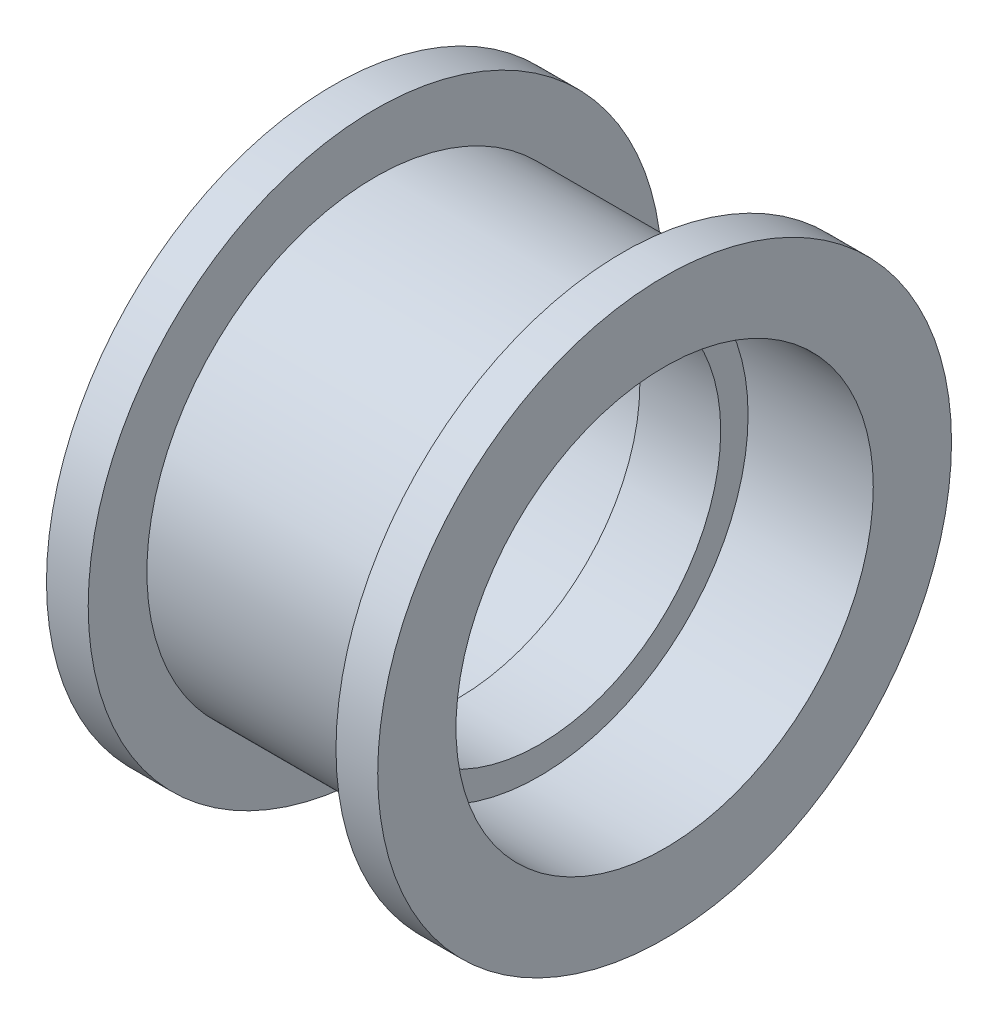
ISO-10303-21;
HEADER;
FILE_DESCRIPTION(('STEP AP214'),'2;1');
FILE_NAME('part.step','',(''),(''),'','','');
FILE_SCHEMA(('AUTOMOTIVE_DESIGN { 1 0 10303 214 1 1 1 1 }'));
ENDSEC;
DATA;
#1=APPLICATION_CONTEXT('core data for automotive mechanical design processes');
#2=APPLICATION_PROTOCOL_DEFINITION('international standard','automotive_design',2000,#1);
#3=PRODUCT_CONTEXT('',#1,'mechanical');
#4=PRODUCT('Part','Part','',(#3));
#5=PRODUCT_RELATED_PRODUCT_CATEGORY('part','',(#4));
#6=PRODUCT_DEFINITION_FORMATION('','',#4);
#7=PRODUCT_DEFINITION_CONTEXT('part definition',#1,'design');
#8=PRODUCT_DEFINITION('design','',#6,#7);
#9=PRODUCT_DEFINITION_SHAPE('','',#8);
#10=(LENGTH_UNIT() NAMED_UNIT(*) SI_UNIT(.MILLI.,.METRE.));
#11=(NAMED_UNIT(*) PLANE_ANGLE_UNIT() SI_UNIT($,.RADIAN.));
#12=(NAMED_UNIT(*) SI_UNIT($,.STERADIAN.) SOLID_ANGLE_UNIT());
#13=UNCERTAINTY_MEASURE_WITH_UNIT(LENGTH_MEASURE(1.E-05),#10,'distance_accuracy_value','');
#14=(GEOMETRIC_REPRESENTATION_CONTEXT(3) GLOBAL_UNCERTAINTY_ASSIGNED_CONTEXT((#13)) GLOBAL_UNIT_ASSIGNED_CONTEXT((#10,
#11,#12)) REPRESENTATION_CONTEXT('',''));
#15=CARTESIAN_POINT('',(0.,0.,0.));
#16=DIRECTION('',(0.,0.,1.));
#17=DIRECTION('',(1.,0.,0.));
#18=AXIS2_PLACEMENT_3D('',#15,#16,#17);
#19=CARTESIAN_POINT('',(-1.55,6.95,0.));
#20=DIRECTION('',(-1.,0.,0.));
#21=DIRECTION('',(0.,0.,1.));
#22=AXIS2_PLACEMENT_3D('',#19,#20,#21);
#23=PLANE('',#22);
#24=CARTESIAN_POINT('',(-1.55,0.,0.));
#25=DIRECTION('',(1.,0.,0.));
#26=DIRECTION('',(0.,0.,-1.));
#27=AXIS2_PLACEMENT_3D('',#24,#25,#26);
#28=CIRCLE('',#27,6.95);
#29=CARTESIAN_POINT('',(-1.55,0.,-6.95));
#30=VERTEX_POINT('',#29);
#31=EDGE_CURVE('E10',#30,#30,#28,.T.);
#32=ORIENTED_EDGE('',*,*,#31,.T.);
#33=EDGE_LOOP('',(#32));
#34=FACE_BOUND('',#33,.T.);
#35=CARTESIAN_POINT('',(-1.55,0.,0.));
#36=DIRECTION('',(1.,0.,0.));
#37=DIRECTION('',(0.,0.,-1.));
#38=AXIS2_PLACEMENT_3D('',#35,#36,#37);
#39=CIRCLE('',#38,8.);
#40=CARTESIAN_POINT('',(-1.55,0.,-8.));
#41=VERTEX_POINT('',#40);
#42=EDGE_CURVE('E71',#41,#41,#39,.T.);
#43=ORIENTED_EDGE('',*,*,#42,.F.);
#44=EDGE_LOOP('',(#43));
#45=FACE_BOUND('',#44,.T.);
#46=ADVANCED_FACE('F31',(#34,#45),#23,.T.);
#47=CARTESIAN_POINT('',(0.,0.,0.));
#48=DIRECTION('',(1.,0.,0.));
#49=DIRECTION('',(0.,0.,-1.));
#50=AXIS2_PLACEMENT_3D('',#47,#48,#49);
#51=CYLINDRICAL_SURFACE('',#50,6.95);
#52=CARTESIAN_POINT('',(1.55,0.,0.));
#53=DIRECTION('',(1.,0.,0.));
#54=DIRECTION('',(0.,0.,-1.));
#55=AXIS2_PLACEMENT_3D('',#52,#53,#54);
#56=CIRCLE('',#55,6.95);
#57=CARTESIAN_POINT('',(1.55,0.,-6.95));
#58=VERTEX_POINT('',#57);
#59=EDGE_CURVE('E37',#58,#58,#56,.T.);
#60=ORIENTED_EDGE('',*,*,#59,.T.);
#61=EDGE_LOOP('',(#60));
#62=FACE_BOUND('',#61,.T.);
#63=ORIENTED_EDGE('',*,*,#31,.F.);
#64=EDGE_LOOP('',(#63));
#65=FACE_BOUND('',#64,.T.);
#66=ADVANCED_FACE('F79',(#62,#65),#51,.F.);
#67=CARTESIAN_POINT('',(1.55,6.95,0.));
#68=DIRECTION('',(1.,0.,0.));
#69=DIRECTION('',(0.,0.,-1.));
#70=AXIS2_PLACEMENT_3D('',#67,#68,#69);
#71=PLANE('',#70);
#72=CARTESIAN_POINT('',(1.55,0.,0.));
#73=DIRECTION('',(1.,0.,0.));
#74=DIRECTION('',(0.,0.,-1.));
#75=AXIS2_PLACEMENT_3D('',#72,#73,#74);
#76=CIRCLE('',#75,8.);
#77=CARTESIAN_POINT('',(1.55,0.,-8.));
#78=VERTEX_POINT('',#77);
#79=EDGE_CURVE('E41',#78,#78,#76,.T.);
#80=ORIENTED_EDGE('',*,*,#79,.T.);
#81=EDGE_LOOP('',(#80));
#82=FACE_BOUND('',#81,.T.);
#83=ORIENTED_EDGE('',*,*,#59,.F.);
#84=EDGE_LOOP('',(#83));
#85=FACE_BOUND('',#84,.T.);
#86=ADVANCED_FACE('F83',(#82,#85),#71,.T.);
#87=CARTESIAN_POINT('',(0.,0.,0.));
#88=DIRECTION('',(1.,0.,0.));
#89=DIRECTION('',(0.,0.,-1.));
#90=AXIS2_PLACEMENT_3D('',#87,#88,#89);
#91=CYLINDRICAL_SURFACE('',#90,8.);
#92=CARTESIAN_POINT('',(6.35,0.,0.));
#93=DIRECTION('',(1.,0.,0.));
#94=DIRECTION('',(0.,0.,-1.));
#95=AXIS2_PLACEMENT_3D('',#92,#93,#94);
#96=CIRCLE('',#95,8.);
#97=CARTESIAN_POINT('',(6.35,0.,-8.));
#98=VERTEX_POINT('',#97);
#99=EDGE_CURVE('E45',#98,#98,#96,.T.);
#100=ORIENTED_EDGE('',*,*,#99,.T.);
#101=EDGE_LOOP('',(#100));
#102=FACE_BOUND('',#101,.T.);
#103=ORIENTED_EDGE('',*,*,#79,.F.);
#104=EDGE_LOOP('',(#103));
#105=FACE_BOUND('',#104,.T.);
#106=ADVANCED_FACE('F87',(#102,#105),#91,.F.);
#107=CARTESIAN_POINT('',(6.35,8.,0.));
#108=DIRECTION('',(1.,0.,0.));
#109=DIRECTION('',(0.,0.,-1.));
#110=AXIS2_PLACEMENT_3D('',#107,#108,#109);
#111=PLANE('',#110);
#112=CARTESIAN_POINT('',(6.35,0.,0.));
#113=DIRECTION('',(1.,0.,0.));
#114=DIRECTION('',(0.,0.,-1.));
#115=AXIS2_PLACEMENT_3D('',#112,#113,#114);
#116=CIRCLE('',#115,11.);
#117=CARTESIAN_POINT('',(6.35,0.,-11.));
#118=VERTEX_POINT('',#117);
#119=EDGE_CURVE('E50',#118,#118,#116,.T.);
#120=ORIENTED_EDGE('',*,*,#119,.T.);
#121=EDGE_LOOP('',(#120));
#122=FACE_BOUND('',#121,.T.);
#123=ORIENTED_EDGE('',*,*,#99,.F.);
#124=EDGE_LOOP('',(#123));
#125=FACE_BOUND('',#124,.T.);
#126=ADVANCED_FACE('F94',(#122,#125),#111,.T.);
#127=CARTESIAN_POINT('',(0.,0.,0.));
#128=DIRECTION('',(1.,0.,0.));
#129=DIRECTION('',(0.,0.,-1.));
#130=AXIS2_PLACEMENT_3D('',#127,#128,#129);
#131=CYLINDRICAL_SURFACE('',#130,11.);
#132=CARTESIAN_POINT('',(4.75,0.,0.));
#133=DIRECTION('',(1.,0.,0.));
#134=DIRECTION('',(0.,0.,-1.));
#135=AXIS2_PLACEMENT_3D('',#132,#133,#134);
#136=CIRCLE('',#135,11.);
#137=CARTESIAN_POINT('',(4.75,0.,-11.));
#138=VERTEX_POINT('',#137);
#139=EDGE_CURVE('E53',#138,#138,#136,.T.);
#140=ORIENTED_EDGE('',*,*,#139,.T.);
#141=EDGE_LOOP('',(#140));
#142=FACE_BOUND('',#141,.T.);
#143=ORIENTED_EDGE('',*,*,#119,.F.);
#144=EDGE_LOOP('',(#143));
#145=FACE_BOUND('',#144,.T.);
#146=ADVANCED_FACE('F98',(#142,#145),#131,.T.);
#147=CARTESIAN_POINT('',(4.75,11.,0.));
#148=DIRECTION('',(-1.,0.,0.));
#149=DIRECTION('',(0.,0.,1.));
#150=AXIS2_PLACEMENT_3D('',#147,#148,#149);
#151=PLANE('',#150);
#152=CARTESIAN_POINT('',(4.75,0.,0.));
#153=DIRECTION('',(1.,0.,0.));
#154=DIRECTION('',(0.,0.,-1.));
#155=AXIS2_PLACEMENT_3D('',#152,#153,#154);
#156=CIRCLE('',#155,8.75);
#157=CARTESIAN_POINT('',(4.75,0.,-8.75));
#158=VERTEX_POINT('',#157);
#159=EDGE_CURVE('E56',#158,#158,#156,.T.);
#160=ORIENTED_EDGE('',*,*,#159,.T.);
#161=EDGE_LOOP('',(#160));
#162=FACE_BOUND('',#161,.T.);
#163=ORIENTED_EDGE('',*,*,#139,.F.);
#164=EDGE_LOOP('',(#163));
#165=FACE_BOUND('',#164,.T.);
#166=ADVANCED_FACE('F102',(#162,#165),#151,.T.);
#167=CARTESIAN_POINT('',(0.,0.,0.));
#168=DIRECTION('',(1.,0.,0.));
#169=DIRECTION('',(0.,0.,-1.));
#170=AXIS2_PLACEMENT_3D('',#167,#168,#169);
#171=CYLINDRICAL_SURFACE('',#170,8.75);
#172=CARTESIAN_POINT('',(-4.75,0.,0.));
#173=DIRECTION('',(1.,0.,0.));
#174=DIRECTION('',(0.,0.,-1.));
#175=AXIS2_PLACEMENT_3D('',#172,#173,#174);
#176=CIRCLE('',#175,8.75);
#177=CARTESIAN_POINT('',(-4.75,0.,-8.75));
#178=VERTEX_POINT('',#177);
#179=EDGE_CURVE('E59',#178,#178,#176,.T.);
#180=ORIENTED_EDGE('',*,*,#179,.T.);
#181=EDGE_LOOP('',(#180));
#182=FACE_BOUND('',#181,.T.);
#183=ORIENTED_EDGE('',*,*,#159,.F.);
#184=EDGE_LOOP('',(#183));
#185=FACE_BOUND('',#184,.T.);
#186=ADVANCED_FACE('F106',(#182,#185),#171,.T.);
#187=CARTESIAN_POINT('',(-4.75,11.,0.));
#188=DIRECTION('',(1.,0.,0.));
#189=DIRECTION('',(0.,0.,-1.));
#190=AXIS2_PLACEMENT_3D('',#187,#188,#189);
#191=PLANE('',#190);
#192=CARTESIAN_POINT('',(-4.75,0.,0.));
#193=DIRECTION('',(1.,0.,0.));
#194=DIRECTION('',(0.,0.,-1.));
#195=AXIS2_PLACEMENT_3D('',#192,#193,#194);
#196=CIRCLE('',#195,11.);
#197=CARTESIAN_POINT('',(-4.75,0.,-11.));
#198=VERTEX_POINT('',#197);
#199=EDGE_CURVE('E62',#198,#198,#196,.T.);
#200=ORIENTED_EDGE('',*,*,#199,.T.);
#201=EDGE_LOOP('',(#200));
#202=FACE_BOUND('',#201,.T.);
#203=ORIENTED_EDGE('',*,*,#179,.F.);
#204=EDGE_LOOP('',(#203));
#205=FACE_BOUND('',#204,.T.);
#206=ADVANCED_FACE('F110',(#202,#205),#191,.T.);
#207=CARTESIAN_POINT('',(0.,0.,0.));
#208=DIRECTION('',(1.,0.,0.));
#209=DIRECTION('',(0.,0.,-1.));
#210=AXIS2_PLACEMENT_3D('',#207,#208,#209);
#211=CYLINDRICAL_SURFACE('',#210,11.);
#212=CARTESIAN_POINT('',(-6.35,0.,0.));
#213=DIRECTION('',(1.,0.,0.));
#214=DIRECTION('',(0.,0.,-1.));
#215=AXIS2_PLACEMENT_3D('',#212,#213,#214);
#216=CIRCLE('',#215,11.);
#217=CARTESIAN_POINT('',(-6.35,0.,-11.));
#218=VERTEX_POINT('',#217);
#219=EDGE_CURVE('E65',#218,#218,#216,.T.);
#220=ORIENTED_EDGE('',*,*,#219,.T.);
#221=EDGE_LOOP('',(#220));
#222=FACE_BOUND('',#221,.T.);
#223=ORIENTED_EDGE('',*,*,#199,.F.);
#224=EDGE_LOOP('',(#223));
#225=FACE_BOUND('',#224,.T.);
#226=ADVANCED_FACE('F114',(#222,#225),#211,.T.);
#227=CARTESIAN_POINT('',(-6.35,8.,0.));
#228=DIRECTION('',(-1.,0.,0.));
#229=DIRECTION('',(0.,0.,1.));
#230=AXIS2_PLACEMENT_3D('',#227,#228,#229);
#231=PLANE('',#230);
#232=CARTESIAN_POINT('',(-6.35,0.,0.));
#233=DIRECTION('',(1.,0.,0.));
#234=DIRECTION('',(0.,0.,-1.));
#235=AXIS2_PLACEMENT_3D('',#232,#233,#234);
#236=CIRCLE('',#235,8.);
#237=CARTESIAN_POINT('',(-6.35,0.,-8.));
#238=VERTEX_POINT('',#237);
#239=EDGE_CURVE('E68',#238,#238,#236,.T.);
#240=ORIENTED_EDGE('',*,*,#239,.T.);
#241=EDGE_LOOP('',(#240));
#242=FACE_BOUND('',#241,.T.);
#243=ORIENTED_EDGE('',*,*,#219,.F.);
#244=EDGE_LOOP('',(#243));
#245=FACE_BOUND('',#244,.T.);
#246=ADVANCED_FACE('F118',(#242,#245),#231,.T.);
#247=CARTESIAN_POINT('',(0.,0.,0.));
#248=DIRECTION('',(1.,0.,0.));
#249=DIRECTION('',(0.,0.,-1.));
#250=AXIS2_PLACEMENT_3D('',#247,#248,#249);
#251=CYLINDRICAL_SURFACE('',#250,8.);
#252=ORIENTED_EDGE('',*,*,#42,.T.);
#253=EDGE_LOOP('',(#252));
#254=FACE_BOUND('',#253,.T.);
#255=ORIENTED_EDGE('',*,*,#239,.F.);
#256=EDGE_LOOP('',(#255));
#257=FACE_BOUND('',#256,.T.);
#258=ADVANCED_FACE('F75',(#254,#257),#251,.F.);
#259=CLOSED_SHELL('',(#46,#66,#86,#106,#126,#146,#166,#186,#206,#226,#246,#258));
#260=MANIFOLD_SOLID_BREP('B2',#259);
#261=ADVANCED_BREP_SHAPE_REPRESENTATION('',(#18,#260),#14);
#262=SHAPE_DEFINITION_REPRESENTATION(#9,#261);
ENDSEC;
END-ISO-10303-21;
